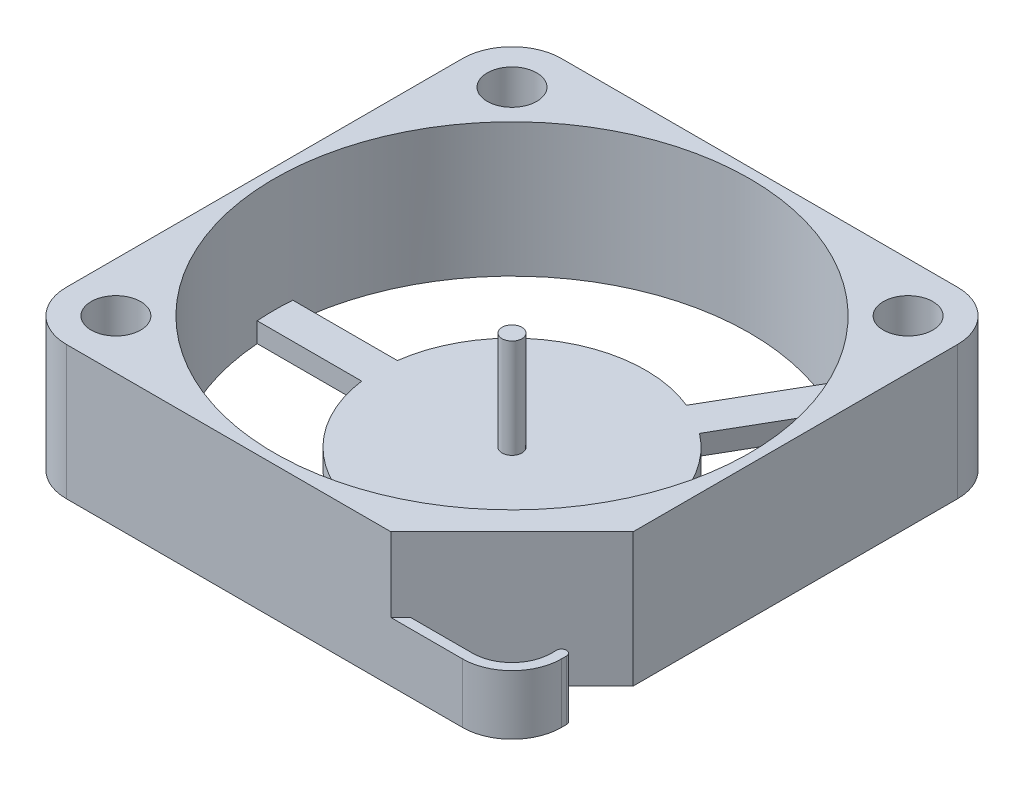
ISO-10303-21;
HEADER;
FILE_DESCRIPTION(('STEP AP214'),'2;1');
FILE_NAME('part.step','',(''),(''),'','','');
FILE_SCHEMA(('AUTOMOTIVE_DESIGN { 1 0 10303 214 1 1 1 1 }'));
ENDSEC;
DATA;
#1=APPLICATION_CONTEXT('core data for automotive mechanical design processes');
#2=APPLICATION_PROTOCOL_DEFINITION('international standard','automotive_design',2000,#1);
#3=PRODUCT_CONTEXT('',#1,'mechanical');
#4=PRODUCT('Part','Part','',(#3));
#5=PRODUCT_RELATED_PRODUCT_CATEGORY('part','',(#4));
#6=PRODUCT_DEFINITION_FORMATION('','',#4);
#7=PRODUCT_DEFINITION_CONTEXT('part definition',#1,'design');
#8=PRODUCT_DEFINITION('design','',#6,#7);
#9=PRODUCT_DEFINITION_SHAPE('','',#8);
#10=(LENGTH_UNIT() NAMED_UNIT(*) SI_UNIT(.MILLI.,.METRE.));
#11=(NAMED_UNIT(*) PLANE_ANGLE_UNIT() SI_UNIT($,.RADIAN.));
#12=(NAMED_UNIT(*) SI_UNIT($,.STERADIAN.) SOLID_ANGLE_UNIT());
#13=UNCERTAINTY_MEASURE_WITH_UNIT(LENGTH_MEASURE(1.E-05),#10,'distance_accuracy_value','');
#14=(GEOMETRIC_REPRESENTATION_CONTEXT(3) GLOBAL_UNCERTAINTY_ASSIGNED_CONTEXT((#13)) GLOBAL_UNIT_ASSIGNED_CONTEXT((#10,
#11,#12)) REPRESENTATION_CONTEXT('',''));
#15=CARTESIAN_POINT('',(0.,0.,0.));
#16=DIRECTION('',(0.,0.,1.));
#17=DIRECTION('',(1.,0.,0.));
#18=AXIS2_PLACEMENT_3D('',#15,#16,#17);
#19=CARTESIAN_POINT('',(0.,6.,0.));
#20=DIRECTION('',(0.,1.,0.));
#21=DIRECTION('',(0.,0.,1.));
#22=AXIS2_PLACEMENT_3D('',#19,#20,#21);
#23=PLANE('',#22);
#24=CARTESIAN_POINT('',(0.,6.,0.));
#25=DIRECTION('',(0.,-1.,0.));
#26=DIRECTION('',(0.,0.,-1.));
#27=AXIS2_PLACEMENT_3D('',#24,#25,#26);
#28=CIRCLE('',#27,0.5);
#29=CARTESIAN_POINT('',(0.,6.,-0.5));
#30=VERTEX_POINT('',#29);
#31=EDGE_CURVE('E239',#30,#30,#28,.T.);
#32=ORIENTED_EDGE('',*,*,#31,.F.);
#33=EDGE_LOOP('',(#32));
#34=FACE_BOUND('',#33,.T.);
#35=ADVANCED_FACE('F24',(#34),#23,.T.);
#36=CARTESIAN_POINT('',(12.25,3.,9.75));
#37=DIRECTION('',(0.,-1.,0.));
#38=DIRECTION('',(0.,0.,-1.));
#39=AXIS2_PLACEMENT_3D('',#36,#37,#38);
#40=CYLINDRICAL_SURFACE('',#39,0.250000000000002);
#41=DIRECTION('',(0.,1.,0.));
#42=VECTOR('',#41,1.);
#43=CARTESIAN_POINT('',(12.5,3.,9.75));
#44=LINE('',#43,#42);
#45=CARTESIAN_POINT('',(12.5,3.,9.75));
#46=VERTEX_POINT('',#45);
#47=CARTESIAN_POINT('',(12.5,0.,9.75));
#48=VERTEX_POINT('',#47);
#49=EDGE_CURVE('E235',#46,#48,#44,.F.);
#50=ORIENTED_EDGE('',*,*,#49,.T.);
#51=CARTESIAN_POINT('',(12.25,0.,9.75));
#52=DIRECTION('',(0.,-1.,0.));
#53=DIRECTION('',(0.,0.,-1.));
#54=AXIS2_PLACEMENT_3D('',#51,#52,#53);
#55=CIRCLE('',#54,0.250000000000002);
#56=CARTESIAN_POINT('',(12.,0.,9.75));
#57=VERTEX_POINT('',#56);
#58=EDGE_CURVE('E228',#48,#57,#55,.F.);
#59=ORIENTED_EDGE('',*,*,#58,.T.);
#60=DIRECTION('',(0.,1.,0.));
#61=VECTOR('',#60,1.);
#62=CARTESIAN_POINT('',(12.,3.,9.75));
#63=LINE('',#62,#61);
#64=CARTESIAN_POINT('',(12.,3.,9.75));
#65=VERTEX_POINT('',#64);
#66=EDGE_CURVE('E232',#57,#65,#63,.T.);
#67=ORIENTED_EDGE('',*,*,#66,.T.);
#68=CARTESIAN_POINT('',(12.25,3.,9.75));
#69=DIRECTION('',(0.,-1.,0.));
#70=DIRECTION('',(0.,0.,-1.));
#71=AXIS2_PLACEMENT_3D('',#68,#69,#70);
#72=CIRCLE('',#71,0.250000000000002);
#73=EDGE_CURVE('E27',#65,#46,#72,.T.);
#74=ORIENTED_EDGE('',*,*,#73,.T.);
#75=EDGE_LOOP('',(#50,#59,#67,#74));
#76=FACE_BOUND('',#75,.T.);
#77=ADVANCED_FACE('F230',(#76),#40,.T.);
#78=CARTESIAN_POINT('',(0.,6.,0.));
#79=DIRECTION('',(0.,-1.,0.));
#80=DIRECTION('',(0.,0.,-1.));
#81=AXIS2_PLACEMENT_3D('',#78,#79,#80);
#82=CYLINDRICAL_SURFACE('',#81,0.5);
#83=ORIENTED_EDGE('',*,*,#31,.T.);
#84=EDGE_LOOP('',(#83));
#85=FACE_BOUND('',#84,.T.);
#86=CARTESIAN_POINT('',(0.,1.,0.));
#87=DIRECTION('',(0.,-1.,0.));
#88=DIRECTION('',(0.,0.,-1.));
#89=AXIS2_PLACEMENT_3D('',#86,#87,#88);
#90=CIRCLE('',#89,0.5);
#91=CARTESIAN_POINT('',(0.,1.,-0.5));
#92=VERTEX_POINT('',#91);
#93=EDGE_CURVE('E398',#92,#92,#90,.T.);
#94=ORIENTED_EDGE('',*,*,#93,.F.);
#95=EDGE_LOOP('',(#94));
#96=FACE_BOUND('',#95,.T.);
#97=ADVANCED_FACE('F914',(#85,#96),#82,.T.);
#98=CARTESIAN_POINT('',(12.,3.,10.));
#99=DIRECTION('',(1.,0.,0.));
#100=DIRECTION('',(0.,0.,-1.));
#101=AXIS2_PLACEMENT_3D('',#98,#99,#100);
#102=PLANE('',#101);
#103=DIRECTION('',(0.,-1.,0.));
#104=VECTOR('',#103,1.);
#105=CARTESIAN_POINT('',(12.,3.,10.));
#106=LINE('',#105,#104);
#107=CARTESIAN_POINT('',(12.,0.,9.99999999999999));
#108=VERTEX_POINT('',#107);
#109=CARTESIAN_POINT('',(12.,3.,10.));
#110=VERTEX_POINT('',#109);
#111=EDGE_CURVE('E377',#108,#110,#106,.F.);
#112=ORIENTED_EDGE('',*,*,#111,.T.);
#113=DIRECTION('',(0.,0.,-1.));
#114=VECTOR('',#113,1.);
#115=CARTESIAN_POINT('',(12.,3.,10.));
#116=LINE('',#115,#114);
#117=EDGE_CURVE('E254',#110,#65,#116,.T.);
#118=ORIENTED_EDGE('',*,*,#117,.T.);
#119=ORIENTED_EDGE('',*,*,#66,.F.);
#120=DIRECTION('',(0.,0.,-1.));
#121=VECTOR('',#120,1.);
#122=CARTESIAN_POINT('',(12.,0.,10.));
#123=LINE('',#122,#121);
#124=EDGE_CURVE('E241',#108,#57,#123,.T.);
#125=ORIENTED_EDGE('',*,*,#124,.F.);
#126=EDGE_LOOP('',(#112,#118,#119,#125));
#127=FACE_BOUND('',#126,.T.);
#128=ADVANCED_FACE('F252',(#127),#102,.F.);
#129=CARTESIAN_POINT('',(12.5,3.,9.75));
#130=DIRECTION('',(-1.,0.,0.));
#131=DIRECTION('',(0.,0.,1.));
#132=AXIS2_PLACEMENT_3D('',#129,#130,#131);
#133=PLANE('',#132);
#134=ORIENTED_EDGE('',*,*,#49,.F.);
#135=DIRECTION('',(0.,0.,-1.));
#136=VECTOR('',#135,1.);
#137=CARTESIAN_POINT('',(12.5,3.,10.));
#138=LINE('',#137,#136);
#139=CARTESIAN_POINT('',(12.5,3.,10.));
#140=VERTEX_POINT('',#139);
#141=EDGE_CURVE('E401',#46,#140,#138,.F.);
#142=ORIENTED_EDGE('',*,*,#141,.T.);
#143=DIRECTION('',(0.,-1.,0.));
#144=VECTOR('',#143,1.);
#145=CARTESIAN_POINT('',(12.5,3.,10.));
#146=LINE('',#145,#144);
#147=CARTESIAN_POINT('',(12.5,0.,10.));
#148=VERTEX_POINT('',#147);
#149=EDGE_CURVE('E372',#148,#140,#146,.F.);
#150=ORIENTED_EDGE('',*,*,#149,.F.);
#151=DIRECTION('',(0.,0.,1.));
#152=VECTOR('',#151,1.);
#153=CARTESIAN_POINT('',(12.5,0.,9.75));
#154=LINE('',#153,#152);
#155=EDGE_CURVE('E417',#48,#148,#154,.T.);
#156=ORIENTED_EDGE('',*,*,#155,.F.);
#157=EDGE_LOOP('',(#134,#142,#150,#156));
#158=FACE_BOUND('',#157,.T.);
#159=ADVANCED_FACE('F909',(#158),#133,.F.);
#160=CARTESIAN_POINT('',(10.,3.,10.));
#161=DIRECTION('',(0.,-1.,0.));
#162=DIRECTION('',(0.,0.,-1.));
#163=AXIS2_PLACEMENT_3D('',#160,#161,#162);
#164=PLANE('',#163);
#165=DIRECTION('',(-0.707106781186548,0.,0.707106781186547));
#166=VECTOR('',#165,1.);
#167=CARTESIAN_POINT('',(6.37975105768082,3.,12.5));
#168=LINE('',#167,#166);
#169=CARTESIAN_POINT('',(6.87975105768085,3.,12.));
#170=VERTEX_POINT('',#169);
#171=CARTESIAN_POINT('',(6.37975105768082,3.,12.5));
#172=VERTEX_POINT('',#171);
#173=EDGE_CURVE('E381',#170,#172,#168,.T.);
#174=ORIENTED_EDGE('',*,*,#173,.T.);
#175=DIRECTION('',(-1.,0.,0.));
#176=VECTOR('',#175,1.);
#177=CARTESIAN_POINT('',(6.37975105768082,3.,12.5));
#178=LINE('',#177,#176);
#179=CARTESIAN_POINT('',(10.,3.,12.5));
#180=VERTEX_POINT('',#179);
#181=EDGE_CURVE('E427',#172,#180,#178,.F.);
#182=ORIENTED_EDGE('',*,*,#181,.T.);
#183=CARTESIAN_POINT('',(10.,3.,10.));
#184=DIRECTION('',(0.,-1.,0.));
#185=DIRECTION('',(0.,0.,-1.));
#186=AXIS2_PLACEMENT_3D('',#183,#184,#185);
#187=CIRCLE('',#186,2.5);
#188=EDGE_CURVE('E368',#140,#180,#187,.T.);
#189=ORIENTED_EDGE('',*,*,#188,.F.);
#190=ORIENTED_EDGE('',*,*,#141,.F.);
#191=ORIENTED_EDGE('',*,*,#73,.F.);
#192=ORIENTED_EDGE('',*,*,#117,.F.);
#193=CARTESIAN_POINT('',(10.,3.,10.));
#194=DIRECTION('',(0.,-1.,0.));
#195=DIRECTION('',(0.,0.,-1.));
#196=AXIS2_PLACEMENT_3D('',#193,#194,#195);
#197=CIRCLE('',#196,1.99999999999999);
#198=CARTESIAN_POINT('',(10.,3.,12.));
#199=VERTEX_POINT('',#198);
#200=EDGE_CURVE('E373',#110,#199,#197,.T.);
#201=ORIENTED_EDGE('',*,*,#200,.T.);
#202=DIRECTION('',(1.,0.,0.));
#203=VECTOR('',#202,1.);
#204=CARTESIAN_POINT('',(6.1726442764943,3.,12.));
#205=LINE('',#204,#203);
#206=EDGE_CURVE('E438',#199,#170,#205,.F.);
#207=ORIENTED_EDGE('',*,*,#206,.T.);
#208=EDGE_LOOP('',(#174,#182,#189,#190,#191,#192,#201,#207));
#209=FACE_BOUND('',#208,.T.);
#210=ADVANCED_FACE('F650',(#209),#164,.F.);
#211=CARTESIAN_POINT('',(-10.,6.75,10.));
#212=DIRECTION('',(0.,-1.,0.));
#213=DIRECTION('',(0.,0.,-1.));
#214=AXIS2_PLACEMENT_3D('',#211,#212,#213);
#215=PLANE('',#214);
#216=CARTESIAN_POINT('',(-10.,6.75,10.));
#217=DIRECTION('',(0.,-1.,0.));
#218=DIRECTION('',(0.,0.,-1.));
#219=AXIS2_PLACEMENT_3D('',#216,#217,#218);
#220=CIRCLE('',#219,1.25);
#221=CARTESIAN_POINT('',(-10.,6.75,8.75));
#222=VERTEX_POINT('',#221);
#223=EDGE_CURVE('E378',#222,#222,#220,.T.);
#224=ORIENTED_EDGE('',*,*,#223,.T.);
#225=EDGE_LOOP('',(#224));
#226=FACE_BOUND('',#225,.T.);
#227=CARTESIAN_POINT('',(0.,6.75,0.));
#228=DIRECTION('',(0.,-1.,0.));
#229=DIRECTION('',(0.,0.,-1.));
#230=AXIS2_PLACEMENT_3D('',#227,#228,#229);
#231=CIRCLE('',#230,12.);
#232=CARTESIAN_POINT('',(0.,6.75,-12.));
#233=VERTEX_POINT('',#232);
#234=EDGE_CURVE('E326',#233,#233,#231,.T.);
#235=ORIENTED_EDGE('',*,*,#234,.T.);
#236=EDGE_LOOP('',(#235));
#237=FACE_BOUND('',#236,.T.);
#238=DIRECTION('',(-1.,0.,0.));
#239=VECTOR('',#238,1.);
#240=CARTESIAN_POINT('',(6.37975105768082,6.75,12.5));
#241=LINE('',#240,#239);
#242=CARTESIAN_POINT('',(-10.,6.75,12.5));
#243=VERTEX_POINT('',#242);
#244=CARTESIAN_POINT('',(6.37975105768082,6.75,12.5));
#245=VERTEX_POINT('',#244);
#246=EDGE_CURVE('E371',#243,#245,#241,.F.);
#247=ORIENTED_EDGE('',*,*,#246,.T.);
#248=DIRECTION('',(-0.707106781186548,0.,0.707106781186547));
#249=VECTOR('',#248,1.);
#250=CARTESIAN_POINT('',(6.37975105768082,6.75,12.5));
#251=LINE('',#250,#249);
#252=CARTESIAN_POINT('',(12.5,6.75,6.37975105768085));
#253=VERTEX_POINT('',#252);
#254=EDGE_CURVE('E433',#245,#253,#251,.F.);
#255=ORIENTED_EDGE('',*,*,#254,.T.);
#256=DIRECTION('',(0.,0.,1.));
#257=VECTOR('',#256,1.);
#258=CARTESIAN_POINT('',(12.5,6.75,6.37975105768085));
#259=LINE('',#258,#257);
#260=CARTESIAN_POINT('',(12.5,6.75,-10.));
#261=VERTEX_POINT('',#260);
#262=EDGE_CURVE('E526',#253,#261,#259,.F.);
#263=ORIENTED_EDGE('',*,*,#262,.T.);
#264=CARTESIAN_POINT('',(10.,6.75,-10.));
#265=DIRECTION('',(0.,-1.,0.));
#266=DIRECTION('',(0.,0.,-1.));
#267=AXIS2_PLACEMENT_3D('',#264,#265,#266);
#268=CIRCLE('',#267,2.5);
#269=CARTESIAN_POINT('',(10.,6.75,-12.5));
#270=VERTEX_POINT('',#269);
#271=EDGE_CURVE('E351',#270,#261,#268,.T.);
#272=ORIENTED_EDGE('',*,*,#271,.F.);
#273=DIRECTION('',(1.,0.,0.));
#274=VECTOR('',#273,1.);
#275=CARTESIAN_POINT('',(10.,6.75,-12.5));
#276=LINE('',#275,#274);
#277=CARTESIAN_POINT('',(-10.,6.75,-12.5));
#278=VERTEX_POINT('',#277);
#279=EDGE_CURVE('E361',#270,#278,#276,.F.);
#280=ORIENTED_EDGE('',*,*,#279,.T.);
#281=CARTESIAN_POINT('',(-10.,6.75,-10.));
#282=DIRECTION('',(0.,-1.,0.));
#283=DIRECTION('',(0.,0.,-1.));
#284=AXIS2_PLACEMENT_3D('',#281,#282,#283);
#285=CIRCLE('',#284,2.5);
#286=CARTESIAN_POINT('',(-12.5,6.75,-10.));
#287=VERTEX_POINT('',#286);
#288=EDGE_CURVE('E357',#287,#278,#285,.T.);
#289=ORIENTED_EDGE('',*,*,#288,.F.);
#290=DIRECTION('',(0.,0.,-1.));
#291=VECTOR('',#290,1.);
#292=CARTESIAN_POINT('',(-12.5,6.75,10.));
#293=LINE('',#292,#291);
#294=CARTESIAN_POINT('',(-12.5,6.75,10.));
#295=VERTEX_POINT('',#294);
#296=EDGE_CURVE('E366',#287,#295,#293,.F.);
#297=ORIENTED_EDGE('',*,*,#296,.T.);
#298=CARTESIAN_POINT('',(-10.,6.75,10.));
#299=DIRECTION('',(0.,-1.,0.));
#300=DIRECTION('',(0.,0.,-1.));
#301=AXIS2_PLACEMENT_3D('',#298,#299,#300);
#302=CIRCLE('',#301,2.5);
#303=EDGE_CURVE('E363',#243,#295,#302,.T.);
#304=ORIENTED_EDGE('',*,*,#303,.F.);
#305=EDGE_LOOP('',(#247,#255,#263,#272,#280,#289,#297,#304));
#306=FACE_BOUND('',#305,.T.);
#307=CARTESIAN_POINT('',(-10.,6.75,-10.));
#308=DIRECTION('',(0.,-1.,0.));
#309=DIRECTION('',(0.,0.,-1.));
#310=AXIS2_PLACEMENT_3D('',#307,#308,#309);
#311=CIRCLE('',#310,1.25);
#312=CARTESIAN_POINT('',(-10.,6.75,-11.25));
#313=VERTEX_POINT('',#312);
#314=EDGE_CURVE('E389',#313,#313,#311,.T.);
#315=ORIENTED_EDGE('',*,*,#314,.T.);
#316=EDGE_LOOP('',(#315));
#317=FACE_BOUND('',#316,.T.);
#318=CARTESIAN_POINT('',(10.,6.75,-10.));
#319=DIRECTION('',(0.,-1.,0.));
#320=DIRECTION('',(0.,0.,-1.));
#321=AXIS2_PLACEMENT_3D('',#318,#319,#320);
#322=CIRCLE('',#321,1.25);
#323=CARTESIAN_POINT('',(10.,6.75,-11.25));
#324=VERTEX_POINT('',#323);
#325=EDGE_CURVE('E394',#324,#324,#322,.T.);
#326=ORIENTED_EDGE('',*,*,#325,.T.);
#327=EDGE_LOOP('',(#326));
#328=FACE_BOUND('',#327,.T.);
#329=ADVANCED_FACE('F768',(#226,#237,#306,#317,#328),#215,.F.);
#330=CARTESIAN_POINT('',(0.,1.,0.));
#331=DIRECTION('',(0.,1.,0.));
#332=DIRECTION('',(0.,0.,1.));
#333=AXIS2_PLACEMENT_3D('',#330,#331,#332);
#334=PLANE('',#333);
#335=ORIENTED_EDGE('',*,*,#93,.T.);
#336=EDGE_LOOP('',(#335));
#337=FACE_BOUND('',#336,.T.);
#338=CARTESIAN_POINT('',(0.,1.,0.));
#339=DIRECTION('',(0.,-1.,0.));
#340=DIRECTION('',(0.,0.,-1.));
#341=AXIS2_PLACEMENT_3D('',#338,#339,#340);
#342=CIRCLE('',#341,6.75);
#343=CARTESIAN_POINT('',(-6.68973093629333,1.,-0.900000000000001));
#344=VERTEX_POINT('',#343);
#345=CARTESIAN_POINT('',(2.56544260474067,1.,-6.24347693531268));
#346=VERTEX_POINT('',#345);
#347=EDGE_CURVE('E340',#344,#346,#342,.T.);
#348=ORIENTED_EDGE('',*,*,#347,.F.);
#349=DIRECTION('',(1.,0.,0.));
#350=VECTOR('',#349,1.);
#351=CARTESIAN_POINT('',(-11.9662024051075,1.,-0.900000000000001));
#352=LINE('',#351,#350);
#353=CARTESIAN_POINT('',(-11.9662024051075,1.,-0.900000000000001));
#354=VERTEX_POINT('',#353);
#355=EDGE_CURVE('E511',#344,#354,#352,.F.);
#356=ORIENTED_EDGE('',*,*,#355,.T.);
#357=CARTESIAN_POINT('',(0.,1.,0.));
#358=DIRECTION('',(0.,-1.,0.));
#359=DIRECTION('',(0.,0.,-1.));
#360=AXIS2_PLACEMENT_3D('',#357,#358,#359);
#361=CIRCLE('',#360,12.);
#362=CARTESIAN_POINT('',(-11.9662024051075,1.,0.900000000000006));
#363=VERTEX_POINT('',#362);
#364=EDGE_CURVE('E346',#354,#363,#361,.F.);
#365=ORIENTED_EDGE('',*,*,#364,.T.);
#366=DIRECTION('',(-1.,0.,0.));
#367=VECTOR('',#366,1.);
#368=CARTESIAN_POINT('',(-11.9662024051075,1.,0.900000000000001));
#369=LINE('',#368,#367);
#370=CARTESIAN_POINT('',(-6.68973093629333,1.,0.900000000000002));
#371=VERTEX_POINT('',#370);
#372=EDGE_CURVE('E387',#363,#371,#369,.F.);
#373=ORIENTED_EDGE('',*,*,#372,.T.);
#374=CARTESIAN_POINT('',(0.,1.,0.));
#375=DIRECTION('',(0.,-1.,0.));
#376=DIRECTION('',(0.,0.,-1.));
#377=AXIS2_PLACEMENT_3D('',#374,#375,#376);
#378=CIRCLE('',#377,6.75);
#379=CARTESIAN_POINT('',(2.56544260474067,1.,6.24347693531267));
#380=VERTEX_POINT('',#379);
#381=EDGE_CURVE('E383',#380,#371,#378,.T.);
#382=ORIENTED_EDGE('',*,*,#381,.F.);
#383=DIRECTION('',(-0.5,0.,-0.866025403784438));
#384=VECTOR('',#383,1.);
#385=CARTESIAN_POINT('',(5.20367833914775,1.,10.8130352696495));
#386=LINE('',#385,#384);
#387=CARTESIAN_POINT('',(5.20367833914775,1.,10.8130352696495));
#388=VERTEX_POINT('',#387);
#389=EDGE_CURVE('E393',#380,#388,#386,.F.);
#390=ORIENTED_EDGE('',*,*,#389,.T.);
#391=CARTESIAN_POINT('',(0.,1.,0.));
#392=DIRECTION('',(0.,-1.,0.));
#393=DIRECTION('',(0.,0.,-1.));
#394=AXIS2_PLACEMENT_3D('',#391,#392,#393);
#395=CIRCLE('',#394,12.);
#396=CARTESIAN_POINT('',(6.76252406595974,1.,9.91303526964952));
#397=VERTEX_POINT('',#396);
#398=EDGE_CURVE('E336',#388,#397,#395,.F.);
#399=ORIENTED_EDGE('',*,*,#398,.T.);
#400=DIRECTION('',(0.5,0.,0.866025403784438));
#401=VECTOR('',#400,1.);
#402=CARTESIAN_POINT('',(6.76252406595974,1.,9.91303526964952));
#403=LINE('',#402,#401);
#404=CARTESIAN_POINT('',(4.12428833155266,1.,5.34347693531267));
#405=VERTEX_POINT('',#404);
#406=EDGE_CURVE('E509',#397,#405,#403,.F.);
#407=ORIENTED_EDGE('',*,*,#406,.T.);
#408=CARTESIAN_POINT('',(0.,1.,0.));
#409=DIRECTION('',(0.,-1.,0.));
#410=DIRECTION('',(0.,0.,-1.));
#411=AXIS2_PLACEMENT_3D('',#408,#409,#410);
#412=CIRCLE('',#411,6.75);
#413=CARTESIAN_POINT('',(4.12428833155266,1.,-5.34347693531268));
#414=VERTEX_POINT('',#413);
#415=EDGE_CURVE('E322',#414,#405,#412,.T.);
#416=ORIENTED_EDGE('',*,*,#415,.F.);
#417=DIRECTION('',(-0.5,0.,0.866025403784439));
#418=VECTOR('',#417,1.);
#419=CARTESIAN_POINT('',(6.76252406595973,1.,-9.91303526964953));
#420=LINE('',#419,#418);
#421=CARTESIAN_POINT('',(6.76252406595973,1.,-9.91303526964952));
#422=VERTEX_POINT('',#421);
#423=EDGE_CURVE('E330',#414,#422,#420,.F.);
#424=ORIENTED_EDGE('',*,*,#423,.T.);
#425=CARTESIAN_POINT('',(0.,1.,0.));
#426=DIRECTION('',(0.,-1.,0.));
#427=DIRECTION('',(0.,0.,-1.));
#428=AXIS2_PLACEMENT_3D('',#425,#426,#427);
#429=CIRCLE('',#428,12.);
#430=CARTESIAN_POINT('',(5.20367833914774,1.,-10.8130352696495));
#431=VERTEX_POINT('',#430);
#432=EDGE_CURVE('E332',#422,#431,#429,.F.);
#433=ORIENTED_EDGE('',*,*,#432,.T.);
#434=DIRECTION('',(0.5,0.,-0.866025403784439));
#435=VECTOR('',#434,1.);
#436=CARTESIAN_POINT('',(5.20367833914774,1.,-10.8130352696495));
#437=LINE('',#436,#435);
#438=EDGE_CURVE('E350',#431,#346,#437,.F.);
#439=ORIENTED_EDGE('',*,*,#438,.T.);
#440=EDGE_LOOP('',(#348,#356,#365,#373,#382,#390,#399,#407,#416,#424,#433,#439));
#441=FACE_BOUND('',#440,.T.);
#442=ADVANCED_FACE('F826',(#337,#441),#334,.T.);
#443=CARTESIAN_POINT('',(10.,6.75,-10.));
#444=DIRECTION('',(0.,-1.,0.));
#445=DIRECTION('',(0.,0.,-1.));
#446=AXIS2_PLACEMENT_3D('',#443,#444,#445);
#447=CYLINDRICAL_SURFACE('',#446,1.25);
#448=ORIENTED_EDGE('',*,*,#325,.F.);
#449=EDGE_LOOP('',(#448));
#450=FACE_BOUND('',#449,.T.);
#451=CARTESIAN_POINT('',(10.,0.,-10.));
#452=DIRECTION('',(0.,-1.,0.));
#453=DIRECTION('',(0.,0.,-1.));
#454=AXIS2_PLACEMENT_3D('',#451,#452,#453);
#455=CIRCLE('',#454,1.25);
#456=CARTESIAN_POINT('',(10.,0.,-11.25));
#457=VERTEX_POINT('',#456);
#458=EDGE_CURVE('E317',#457,#457,#455,.F.);
#459=ORIENTED_EDGE('',*,*,#458,.F.);
#460=EDGE_LOOP('',(#459));
#461=FACE_BOUND('',#460,.T.);
#462=ADVANCED_FACE('F822',(#450,#461),#447,.F.);
#463=CARTESIAN_POINT('',(-10.,6.75,-10.));
#464=DIRECTION('',(0.,-1.,0.));
#465=DIRECTION('',(0.,0.,-1.));
#466=AXIS2_PLACEMENT_3D('',#463,#464,#465);
#467=CYLINDRICAL_SURFACE('',#466,1.25);
#468=ORIENTED_EDGE('',*,*,#314,.F.);
#469=EDGE_LOOP('',(#468));
#470=FACE_BOUND('',#469,.T.);
#471=CARTESIAN_POINT('',(-10.,0.,-10.));
#472=DIRECTION('',(0.,-1.,0.));
#473=DIRECTION('',(0.,0.,-1.));
#474=AXIS2_PLACEMENT_3D('',#471,#472,#473);
#475=CIRCLE('',#474,1.25);
#476=CARTESIAN_POINT('',(-10.,0.,-11.25));
#477=VERTEX_POINT('',#476);
#478=EDGE_CURVE('E313',#477,#477,#475,.F.);
#479=ORIENTED_EDGE('',*,*,#478,.F.);
#480=EDGE_LOOP('',(#479));
#481=FACE_BOUND('',#480,.T.);
#482=ADVANCED_FACE('F825',(#470,#481),#467,.F.);
#483=CARTESIAN_POINT('',(5.20367833914775,1.,10.8130352696495));
#484=DIRECTION('',(0.866025403784438,0.,-0.5));
#485=DIRECTION('',(-0.5,0.,-0.866025403784438));
#486=AXIS2_PLACEMENT_3D('',#483,#484,#485);
#487=PLANE('',#486);
#488=DIRECTION('',(0.,-1.,0.));
#489=VECTOR('',#488,1.);
#490=CARTESIAN_POINT('',(5.20367833914775,6.75,10.8130352696495));
#491=LINE('',#490,#489);
#492=CARTESIAN_POINT('',(5.20367833914775,0.,10.8130352696495));
#493=VERTEX_POINT('',#492);
#494=EDGE_CURVE('E339',#493,#388,#491,.F.);
#495=ORIENTED_EDGE('',*,*,#494,.T.);
#496=ORIENTED_EDGE('',*,*,#389,.F.);
#497=DIRECTION('',(0.,-1.,0.));
#498=VECTOR('',#497,1.);
#499=CARTESIAN_POINT('',(2.56544260474067,1.,6.24347693531267));
#500=LINE('',#499,#498);
#501=CARTESIAN_POINT('',(2.56544260474067,0.,6.24347693531267));
#502=VERTEX_POINT('',#501);
#503=EDGE_CURVE('E388',#502,#380,#500,.F.);
#504=ORIENTED_EDGE('',*,*,#503,.F.);
#505=DIRECTION('',(-0.5,0.,-0.866025403784438));
#506=VECTOR('',#505,1.);
#507=CARTESIAN_POINT('',(5.20367833914775,0.,10.8130352696495));
#508=LINE('',#507,#506);
#509=EDGE_CURVE('E309',#493,#502,#508,.T.);
#510=ORIENTED_EDGE('',*,*,#509,.F.);
#511=EDGE_LOOP('',(#495,#496,#504,#510));
#512=FACE_BOUND('',#511,.T.);
#513=ADVANCED_FACE('F775',(#512),#487,.F.);
#514=CARTESIAN_POINT('',(0.,1.,0.));
#515=DIRECTION('',(0.,-1.,0.));
#516=DIRECTION('',(0.,0.,-1.));
#517=AXIS2_PLACEMENT_3D('',#514,#515,#516);
#518=CYLINDRICAL_SURFACE('',#517,6.75);
#519=ORIENTED_EDGE('',*,*,#381,.T.);
#520=DIRECTION('',(0.,1.,0.));
#521=VECTOR('',#520,1.);
#522=CARTESIAN_POINT('',(-6.68973093629333,1.,0.900000000000002));
#523=LINE('',#522,#521);
#524=CARTESIAN_POINT('',(-6.68973093629333,0.,0.900000000000002));
#525=VERTEX_POINT('',#524);
#526=EDGE_CURVE('E382',#371,#525,#523,.F.);
#527=ORIENTED_EDGE('',*,*,#526,.T.);
#528=CARTESIAN_POINT('',(0.,0.,0.));
#529=DIRECTION('',(0.,-1.,0.));
#530=DIRECTION('',(0.,0.,-1.));
#531=AXIS2_PLACEMENT_3D('',#528,#529,#530);
#532=CIRCLE('',#531,6.75);
#533=EDGE_CURVE('E305',#502,#525,#532,.T.);
#534=ORIENTED_EDGE('',*,*,#533,.F.);
#535=ORIENTED_EDGE('',*,*,#503,.T.);
#536=EDGE_LOOP('',(#519,#527,#534,#535));
#537=FACE_BOUND('',#536,.T.);
#538=ADVANCED_FACE('F771',(#537),#518,.T.);
#539=CARTESIAN_POINT('',(-11.9662024051075,1.,0.900000000000001));
#540=DIRECTION('',(0.,0.,-1.));
#541=DIRECTION('',(-1.,0.,0.));
#542=AXIS2_PLACEMENT_3D('',#539,#540,#541);
#543=PLANE('',#542);
#544=ORIENTED_EDGE('',*,*,#526,.F.);
#545=ORIENTED_EDGE('',*,*,#372,.F.);
#546=DIRECTION('',(0.,-1.,0.));
#547=VECTOR('',#546,1.);
#548=CARTESIAN_POINT('',(-11.9662024051075,6.75,0.900000000000011));
#549=LINE('',#548,#547);
#550=CARTESIAN_POINT('',(-11.9662024051075,0.,0.900000000000006));
#551=VERTEX_POINT('',#550);
#552=EDGE_CURVE('E349',#363,#551,#549,.T.);
#553=ORIENTED_EDGE('',*,*,#552,.T.);
#554=DIRECTION('',(1.,0.,0.));
#555=VECTOR('',#554,1.);
#556=CARTESIAN_POINT('',(-10.,0.,0.900000000000001));
#557=LINE('',#556,#555);
#558=EDGE_CURVE('E304',#525,#551,#557,.F.);
#559=ORIENTED_EDGE('',*,*,#558,.F.);
#560=EDGE_LOOP('',(#544,#545,#553,#559));
#561=FACE_BOUND('',#560,.T.);
#562=ADVANCED_FACE('F774',(#561),#543,.F.);
#563=CARTESIAN_POINT('',(-10.,6.75,10.));
#564=DIRECTION('',(0.,-1.,0.));
#565=DIRECTION('',(0.,0.,-1.));
#566=AXIS2_PLACEMENT_3D('',#563,#564,#565);
#567=CYLINDRICAL_SURFACE('',#566,1.25);
#568=ORIENTED_EDGE('',*,*,#223,.F.);
#569=EDGE_LOOP('',(#568));
#570=FACE_BOUND('',#569,.T.);
#571=CARTESIAN_POINT('',(-10.,0.,10.));
#572=DIRECTION('',(0.,-1.,0.));
#573=DIRECTION('',(0.,0.,-1.));
#574=AXIS2_PLACEMENT_3D('',#571,#572,#573);
#575=CIRCLE('',#574,1.25);
#576=CARTESIAN_POINT('',(-10.,0.,8.75));
#577=VERTEX_POINT('',#576);
#578=EDGE_CURVE('E299',#577,#577,#575,.F.);
#579=ORIENTED_EDGE('',*,*,#578,.F.);
#580=EDGE_LOOP('',(#579));
#581=FACE_BOUND('',#580,.T.);
#582=ADVANCED_FACE('F789',(#570,#581),#567,.F.);
#583=CARTESIAN_POINT('',(6.37975105768082,6.75,12.5));
#584=DIRECTION('',(-0.707106781186547,0.,-0.707106781186548));
#585=DIRECTION('',(-0.707106781186548,0.,0.707106781186547));
#586=AXIS2_PLACEMENT_3D('',#583,#584,#585);
#587=PLANE('',#586);
#588=DIRECTION('',(-0.707106781186548,0.,0.707106781186547));
#589=VECTOR('',#588,1.);
#590=CARTESIAN_POINT('',(12.5,0.,6.37975105768085));
#591=LINE('',#590,#589);
#592=CARTESIAN_POINT('',(12.5,0.,6.37975105768084));
#593=VERTEX_POINT('',#592);
#594=CARTESIAN_POINT('',(6.87975105768085,0.,12.));
#595=VERTEX_POINT('',#594);
#596=EDGE_CURVE('E303',#593,#595,#591,.T.);
#597=ORIENTED_EDGE('',*,*,#596,.F.);
#598=DIRECTION('',(0.,1.,0.));
#599=VECTOR('',#598,1.);
#600=CARTESIAN_POINT('',(12.5,6.75,6.37975105768085));
#601=LINE('',#600,#599);
#602=EDGE_CURVE('E355',#593,#253,#601,.T.);
#603=ORIENTED_EDGE('',*,*,#602,.T.);
#604=ORIENTED_EDGE('',*,*,#254,.F.);
#605=DIRECTION('',(0.,1.,0.));
#606=VECTOR('',#605,1.);
#607=CARTESIAN_POINT('',(6.37975105768082,6.75,12.5));
#608=LINE('',#607,#606);
#609=EDGE_CURVE('E423',#245,#172,#608,.F.);
#610=ORIENTED_EDGE('',*,*,#609,.T.);
#611=ORIENTED_EDGE('',*,*,#173,.F.);
#612=DIRECTION('',(0.,1.,0.));
#613=VECTOR('',#612,1.);
#614=CARTESIAN_POINT('',(6.87975105768084,3.,12.));
#615=LINE('',#614,#613);
#616=EDGE_CURVE('E442',#170,#595,#615,.F.);
#617=ORIENTED_EDGE('',*,*,#616,.T.);
#618=EDGE_LOOP('',(#597,#603,#604,#610,#611,#617));
#619=FACE_BOUND('',#618,.T.);
#620=ADVANCED_FACE('F653',(#619),#587,.F.);
#621=CARTESIAN_POINT('',(6.1726442764943,3.,12.));
#622=DIRECTION('',(0.,0.,1.));
#623=DIRECTION('',(1.,0.,0.));
#624=AXIS2_PLACEMENT_3D('',#621,#622,#623);
#625=PLANE('',#624);
#626=ORIENTED_EDGE('',*,*,#616,.F.);
#627=ORIENTED_EDGE('',*,*,#206,.F.);
#628=DIRECTION('',(0.,-1.,0.));
#629=VECTOR('',#628,1.);
#630=CARTESIAN_POINT('',(10.,3.,12.));
#631=LINE('',#630,#629);
#632=CARTESIAN_POINT('',(10.,0.,12.));
#633=VERTEX_POINT('',#632);
#634=EDGE_CURVE('E376',#199,#633,#631,.T.);
#635=ORIENTED_EDGE('',*,*,#634,.T.);
#636=DIRECTION('',(1.,0.,0.));
#637=VECTOR('',#636,1.);
#638=CARTESIAN_POINT('',(-10.,0.,12.));
#639=LINE('',#638,#637);
#640=EDGE_CURVE('E298',#595,#633,#639,.T.);
#641=ORIENTED_EDGE('',*,*,#640,.F.);
#642=EDGE_LOOP('',(#626,#627,#635,#641));
#643=FACE_BOUND('',#642,.T.);
#644=ADVANCED_FACE('F803',(#643),#625,.F.);
#645=CARTESIAN_POINT('',(10.,3.,10.));
#646=DIRECTION('',(0.,-1.,0.));
#647=DIRECTION('',(0.,0.,-1.));
#648=AXIS2_PLACEMENT_3D('',#645,#646,#647);
#649=CYLINDRICAL_SURFACE('',#648,1.99999999999999);
#650=ORIENTED_EDGE('',*,*,#634,.F.);
#651=ORIENTED_EDGE('',*,*,#200,.F.);
#652=ORIENTED_EDGE('',*,*,#111,.F.);
#653=CARTESIAN_POINT('',(10.,0.,10.));
#654=DIRECTION('',(0.,-1.,0.));
#655=DIRECTION('',(0.,0.,-1.));
#656=AXIS2_PLACEMENT_3D('',#653,#654,#655);
#657=CIRCLE('',#656,1.99999999999999);
#658=EDGE_CURVE('E247',#633,#108,#657,.F.);
#659=ORIENTED_EDGE('',*,*,#658,.F.);
#660=EDGE_LOOP('',(#650,#651,#652,#659));
#661=FACE_BOUND('',#660,.T.);
#662=ADVANCED_FACE('F664',(#661),#649,.F.);
#663=CARTESIAN_POINT('',(10.,3.,10.));
#664=DIRECTION('',(0.,-1.,0.));
#665=DIRECTION('',(0.,0.,-1.));
#666=AXIS2_PLACEMENT_3D('',#663,#664,#665);
#667=CYLINDRICAL_SURFACE('',#666,2.5);
#668=ORIENTED_EDGE('',*,*,#188,.T.);
#669=DIRECTION('',(0.,1.,0.));
#670=VECTOR('',#669,1.);
#671=CARTESIAN_POINT('',(10.,6.75,12.5));
#672=LINE('',#671,#670);
#673=CARTESIAN_POINT('',(10.,0.,12.5));
#674=VERTEX_POINT('',#673);
#675=EDGE_CURVE('E479',#180,#674,#672,.F.);
#676=ORIENTED_EDGE('',*,*,#675,.T.);
#677=CARTESIAN_POINT('',(10.,0.,10.));
#678=DIRECTION('',(0.,-1.,0.));
#679=DIRECTION('',(0.,0.,-1.));
#680=AXIS2_PLACEMENT_3D('',#677,#678,#679);
#681=CIRCLE('',#680,2.5);
#682=EDGE_CURVE('E292',#148,#674,#681,.T.);
#683=ORIENTED_EDGE('',*,*,#682,.F.);
#684=ORIENTED_EDGE('',*,*,#149,.T.);
#685=EDGE_LOOP('',(#668,#676,#683,#684));
#686=FACE_BOUND('',#685,.T.);
#687=ADVANCED_FACE('F656',(#686),#667,.T.);
#688=CARTESIAN_POINT('',(6.37975105768082,6.75,12.5));
#689=DIRECTION('',(0.,0.,-1.));
#690=DIRECTION('',(-1.,0.,0.));
#691=AXIS2_PLACEMENT_3D('',#688,#689,#690);
#692=PLANE('',#691);
#693=ORIENTED_EDGE('',*,*,#675,.F.);
#694=ORIENTED_EDGE('',*,*,#181,.F.);
#695=ORIENTED_EDGE('',*,*,#609,.F.);
#696=ORIENTED_EDGE('',*,*,#246,.F.);
#697=DIRECTION('',(0.,-1.,0.));
#698=VECTOR('',#697,1.);
#699=CARTESIAN_POINT('',(-10.,6.75,12.5));
#700=LINE('',#699,#698);
#701=CARTESIAN_POINT('',(-10.,0.,12.5));
#702=VERTEX_POINT('',#701);
#703=EDGE_CURVE('E367',#702,#243,#700,.F.);
#704=ORIENTED_EDGE('',*,*,#703,.F.);
#705=DIRECTION('',(1.,0.,0.));
#706=VECTOR('',#705,1.);
#707=CARTESIAN_POINT('',(-10.,0.,12.5));
#708=LINE('',#707,#706);
#709=EDGE_CURVE('E291',#674,#702,#708,.F.);
#710=ORIENTED_EDGE('',*,*,#709,.F.);
#711=EDGE_LOOP('',(#693,#694,#695,#696,#704,#710));
#712=FACE_BOUND('',#711,.T.);
#713=ADVANCED_FACE('F654',(#712),#692,.F.);
#714=CARTESIAN_POINT('',(-10.,6.75,10.));
#715=DIRECTION('',(0.,-1.,0.));
#716=DIRECTION('',(0.,0.,-1.));
#717=AXIS2_PLACEMENT_3D('',#714,#715,#716);
#718=CYLINDRICAL_SURFACE('',#717,2.5);
#719=ORIENTED_EDGE('',*,*,#303,.T.);
#720=DIRECTION('',(0.,1.,0.));
#721=VECTOR('',#720,1.);
#722=CARTESIAN_POINT('',(-12.5,6.75,10.));
#723=LINE('',#722,#721);
#724=CARTESIAN_POINT('',(-12.5,0.,10.));
#725=VERTEX_POINT('',#724);
#726=EDGE_CURVE('E474',#295,#725,#723,.F.);
#727=ORIENTED_EDGE('',*,*,#726,.T.);
#728=CARTESIAN_POINT('',(-10.,0.,10.));
#729=DIRECTION('',(0.,-1.,0.));
#730=DIRECTION('',(0.,0.,-1.));
#731=AXIS2_PLACEMENT_3D('',#728,#729,#730);
#732=CIRCLE('',#731,2.5);
#733=EDGE_CURVE('E287',#702,#725,#732,.T.);
#734=ORIENTED_EDGE('',*,*,#733,.F.);
#735=ORIENTED_EDGE('',*,*,#703,.T.);
#736=EDGE_LOOP('',(#719,#727,#734,#735));
#737=FACE_BOUND('',#736,.T.);
#738=ADVANCED_FACE('F560',(#737),#718,.T.);
#739=CARTESIAN_POINT('',(-12.5,6.75,10.));
#740=DIRECTION('',(1.,0.,0.));
#741=DIRECTION('',(0.,0.,-1.));
#742=AXIS2_PLACEMENT_3D('',#739,#740,#741);
#743=PLANE('',#742);
#744=ORIENTED_EDGE('',*,*,#726,.F.);
#745=ORIENTED_EDGE('',*,*,#296,.F.);
#746=DIRECTION('',(0.,-1.,0.));
#747=VECTOR('',#746,1.);
#748=CARTESIAN_POINT('',(-12.5,6.75,-10.));
#749=LINE('',#748,#747);
#750=CARTESIAN_POINT('',(-12.5,0.,-10.));
#751=VERTEX_POINT('',#750);
#752=EDGE_CURVE('E362',#751,#287,#749,.F.);
#753=ORIENTED_EDGE('',*,*,#752,.F.);
#754=DIRECTION('',(0.,0.,-1.));
#755=VECTOR('',#754,1.);
#756=CARTESIAN_POINT('',(-12.5,0.,10.));
#757=LINE('',#756,#755);
#758=EDGE_CURVE('E286',#725,#751,#757,.T.);
#759=ORIENTED_EDGE('',*,*,#758,.F.);
#760=EDGE_LOOP('',(#744,#745,#753,#759));
#761=FACE_BOUND('',#760,.T.);
#762=ADVANCED_FACE('F565',(#761),#743,.F.);
#763=CARTESIAN_POINT('',(-10.,6.75,-10.));
#764=DIRECTION('',(0.,-1.,0.));
#765=DIRECTION('',(0.,0.,-1.));
#766=AXIS2_PLACEMENT_3D('',#763,#764,#765);
#767=CYLINDRICAL_SURFACE('',#766,2.5);
#768=ORIENTED_EDGE('',*,*,#288,.T.);
#769=DIRECTION('',(0.,1.,0.));
#770=VECTOR('',#769,1.);
#771=CARTESIAN_POINT('',(-10.,6.75,-12.5));
#772=LINE('',#771,#770);
#773=CARTESIAN_POINT('',(-10.,0.,-12.5));
#774=VERTEX_POINT('',#773);
#775=EDGE_CURVE('E471',#278,#774,#772,.F.);
#776=ORIENTED_EDGE('',*,*,#775,.T.);
#777=CARTESIAN_POINT('',(-10.,0.,-10.));
#778=DIRECTION('',(0.,-1.,0.));
#779=DIRECTION('',(0.,0.,-1.));
#780=AXIS2_PLACEMENT_3D('',#777,#778,#779);
#781=CIRCLE('',#780,2.5);
#782=EDGE_CURVE('E283',#751,#774,#781,.T.);
#783=ORIENTED_EDGE('',*,*,#782,.F.);
#784=ORIENTED_EDGE('',*,*,#752,.T.);
#785=EDGE_LOOP('',(#768,#776,#783,#784));
#786=FACE_BOUND('',#785,.T.);
#787=ADVANCED_FACE('F703',(#786),#767,.T.);
#788=CARTESIAN_POINT('',(10.,6.75,-12.5));
#789=DIRECTION('',(0.,0.,1.));
#790=DIRECTION('',(1.,0.,0.));
#791=AXIS2_PLACEMENT_3D('',#788,#789,#790);
#792=PLANE('',#791);
#793=ORIENTED_EDGE('',*,*,#775,.F.);
#794=ORIENTED_EDGE('',*,*,#279,.F.);
#795=DIRECTION('',(0.,-1.,0.));
#796=VECTOR('',#795,1.);
#797=CARTESIAN_POINT('',(10.,6.75,-12.5));
#798=LINE('',#797,#796);
#799=CARTESIAN_POINT('',(10.,0.,-12.5));
#800=VERTEX_POINT('',#799);
#801=EDGE_CURVE('E356',#800,#270,#798,.F.);
#802=ORIENTED_EDGE('',*,*,#801,.F.);
#803=DIRECTION('',(1.,0.,0.));
#804=VECTOR('',#803,1.);
#805=CARTESIAN_POINT('',(-10.,0.,-12.5));
#806=LINE('',#805,#804);
#807=EDGE_CURVE('E282',#774,#800,#806,.T.);
#808=ORIENTED_EDGE('',*,*,#807,.F.);
#809=EDGE_LOOP('',(#793,#794,#802,#808));
#810=FACE_BOUND('',#809,.T.);
#811=ADVANCED_FACE('F633',(#810),#792,.F.);
#812=CARTESIAN_POINT('',(10.,6.75,-10.));
#813=DIRECTION('',(0.,-1.,0.));
#814=DIRECTION('',(0.,0.,-1.));
#815=AXIS2_PLACEMENT_3D('',#812,#813,#814);
#816=CYLINDRICAL_SURFACE('',#815,2.5);
#817=ORIENTED_EDGE('',*,*,#271,.T.);
#818=DIRECTION('',(0.,1.,0.));
#819=VECTOR('',#818,1.);
#820=CARTESIAN_POINT('',(12.5,6.75,-10.));
#821=LINE('',#820,#819);
#822=CARTESIAN_POINT('',(12.5,0.,-10.));
#823=VERTEX_POINT('',#822);
#824=EDGE_CURVE('E519',#261,#823,#821,.F.);
#825=ORIENTED_EDGE('',*,*,#824,.T.);
#826=CARTESIAN_POINT('',(10.,0.,-10.));
#827=DIRECTION('',(0.,-1.,0.));
#828=DIRECTION('',(0.,0.,-1.));
#829=AXIS2_PLACEMENT_3D('',#826,#827,#828);
#830=CIRCLE('',#829,2.5);
#831=EDGE_CURVE('E278',#800,#823,#830,.T.);
#832=ORIENTED_EDGE('',*,*,#831,.F.);
#833=ORIENTED_EDGE('',*,*,#801,.T.);
#834=EDGE_LOOP('',(#817,#825,#832,#833));
#835=FACE_BOUND('',#834,.T.);
#836=ADVANCED_FACE('F635',(#835),#816,.T.);
#837=CARTESIAN_POINT('',(12.5,6.75,6.37975105768085));
#838=DIRECTION('',(-1.,0.,0.));
#839=DIRECTION('',(0.,0.,1.));
#840=AXIS2_PLACEMENT_3D('',#837,#838,#839);
#841=PLANE('',#840);
#842=ORIENTED_EDGE('',*,*,#824,.F.);
#843=ORIENTED_EDGE('',*,*,#262,.F.);
#844=ORIENTED_EDGE('',*,*,#602,.F.);
#845=DIRECTION('',(0.,0.,-1.));
#846=VECTOR('',#845,1.);
#847=CARTESIAN_POINT('',(12.5,0.,10.));
#848=LINE('',#847,#846);
#849=EDGE_CURVE('E281',#823,#593,#848,.F.);
#850=ORIENTED_EDGE('',*,*,#849,.F.);
#851=EDGE_LOOP('',(#842,#843,#844,#850));
#852=FACE_BOUND('',#851,.T.);
#853=ADVANCED_FACE('F639',(#852),#841,.F.);
#854=CARTESIAN_POINT('',(5.20367833914774,1.,-10.8130352696495));
#855=DIRECTION('',(0.866025403784439,0.,0.5));
#856=DIRECTION('',(0.5,0.,-0.866025403784439));
#857=AXIS2_PLACEMENT_3D('',#854,#855,#856);
#858=PLANE('',#857);
#859=DIRECTION('',(0.,-1.,0.));
#860=VECTOR('',#859,1.);
#861=CARTESIAN_POINT('',(2.56544260474067,1.,-6.24347693531269));
#862=LINE('',#861,#860);
#863=CARTESIAN_POINT('',(2.56544260474067,0.,-6.24347693531268));
#864=VERTEX_POINT('',#863);
#865=EDGE_CURVE('E344',#346,#864,#862,.T.);
#866=ORIENTED_EDGE('',*,*,#865,.F.);
#867=ORIENTED_EDGE('',*,*,#438,.F.);
#868=DIRECTION('',(0.,-1.,0.));
#869=VECTOR('',#868,1.);
#870=CARTESIAN_POINT('',(5.20367833914774,6.75,-10.8130352696495));
#871=LINE('',#870,#869);
#872=CARTESIAN_POINT('',(5.20367833914774,0.,-10.8130352696495));
#873=VERTEX_POINT('',#872);
#874=EDGE_CURVE('E331',#431,#873,#871,.T.);
#875=ORIENTED_EDGE('',*,*,#874,.T.);
#876=DIRECTION('',(0.5,0.,-0.866025403784439));
#877=VECTOR('',#876,1.);
#878=CARTESIAN_POINT('',(2.56544260474067,0.,-6.24347693531269));
#879=LINE('',#878,#877);
#880=EDGE_CURVE('E277',#864,#873,#879,.T.);
#881=ORIENTED_EDGE('',*,*,#880,.F.);
#882=EDGE_LOOP('',(#866,#867,#875,#881));
#883=FACE_BOUND('',#882,.T.);
#884=ADVANCED_FACE('F607',(#883),#858,.F.);
#885=CARTESIAN_POINT('',(-11.9662024051075,1.,-0.900000000000001));
#886=DIRECTION('',(0.,0.,1.));
#887=DIRECTION('',(1.,0.,0.));
#888=AXIS2_PLACEMENT_3D('',#885,#886,#887);
#889=PLANE('',#888);
#890=DIRECTION('',(0.,1.,0.));
#891=VECTOR('',#890,1.);
#892=CARTESIAN_POINT('',(-11.9662024051075,1.,-0.900000000000001));
#893=LINE('',#892,#891);
#894=CARTESIAN_POINT('',(-11.9662024051075,0.,-0.900000000000001));
#895=VERTEX_POINT('',#894);
#896=EDGE_CURVE('E524',#354,#895,#893,.F.);
#897=ORIENTED_EDGE('',*,*,#896,.F.);
#898=ORIENTED_EDGE('',*,*,#355,.F.);
#899=DIRECTION('',(0.,-1.,0.));
#900=VECTOR('',#899,1.);
#901=CARTESIAN_POINT('',(-6.68973093629333,1.,-0.900000000000001));
#902=LINE('',#901,#900);
#903=CARTESIAN_POINT('',(-6.68973093629333,0.,-0.900000000000001));
#904=VERTEX_POINT('',#903);
#905=EDGE_CURVE('E345',#904,#344,#902,.F.);
#906=ORIENTED_EDGE('',*,*,#905,.F.);
#907=DIRECTION('',(1.,0.,0.));
#908=VECTOR('',#907,1.);
#909=CARTESIAN_POINT('',(-10.,0.,-0.900000000000001));
#910=LINE('',#909,#908);
#911=EDGE_CURVE('E273',#895,#904,#910,.T.);
#912=ORIENTED_EDGE('',*,*,#911,.F.);
#913=EDGE_LOOP('',(#897,#898,#906,#912));
#914=FACE_BOUND('',#913,.T.);
#915=ADVANCED_FACE('F690',(#914),#889,.F.);
#916=CARTESIAN_POINT('',(0.,1.,0.));
#917=DIRECTION('',(0.,-1.,0.));
#918=DIRECTION('',(0.,0.,-1.));
#919=AXIS2_PLACEMENT_3D('',#916,#917,#918);
#920=CYLINDRICAL_SURFACE('',#919,6.75);
#921=ORIENTED_EDGE('',*,*,#865,.T.);
#922=CARTESIAN_POINT('',(0.,0.,0.));
#923=DIRECTION('',(0.,-1.,0.));
#924=DIRECTION('',(0.,0.,-1.));
#925=AXIS2_PLACEMENT_3D('',#922,#923,#924);
#926=CIRCLE('',#925,6.75);
#927=EDGE_CURVE('E270',#904,#864,#926,.T.);
#928=ORIENTED_EDGE('',*,*,#927,.F.);
#929=ORIENTED_EDGE('',*,*,#905,.T.);
#930=ORIENTED_EDGE('',*,*,#347,.T.);
#931=EDGE_LOOP('',(#921,#928,#929,#930));
#932=FACE_BOUND('',#931,.T.);
#933=ADVANCED_FACE('F686',(#932),#920,.T.);
#934=CARTESIAN_POINT('',(6.76252406595974,1.,9.91303526964952));
#935=DIRECTION('',(-0.866025403784438,0.,0.5));
#936=DIRECTION('',(0.5,0.,0.866025403784438));
#937=AXIS2_PLACEMENT_3D('',#934,#935,#936);
#938=PLANE('',#937);
#939=DIRECTION('',(0.,-1.,0.));
#940=VECTOR('',#939,1.);
#941=CARTESIAN_POINT('',(4.12428833155266,1.,5.34347693531267));
#942=LINE('',#941,#940);
#943=CARTESIAN_POINT('',(4.12428833155266,0.,5.34347693531267));
#944=VERTEX_POINT('',#943);
#945=EDGE_CURVE('E321',#405,#944,#942,.T.);
#946=ORIENTED_EDGE('',*,*,#945,.F.);
#947=ORIENTED_EDGE('',*,*,#406,.F.);
#948=DIRECTION('',(0.,-1.,0.));
#949=VECTOR('',#948,1.);
#950=CARTESIAN_POINT('',(6.76252406595974,6.75,9.91303526964952));
#951=LINE('',#950,#949);
#952=CARTESIAN_POINT('',(6.76252406595974,0.,9.91303526964952));
#953=VERTEX_POINT('',#952);
#954=EDGE_CURVE('E335',#397,#953,#951,.T.);
#955=ORIENTED_EDGE('',*,*,#954,.T.);
#956=DIRECTION('',(0.5,0.,0.866025403784438));
#957=VECTOR('',#956,1.);
#958=CARTESIAN_POINT('',(4.12428833155266,0.,5.34347693531267));
#959=LINE('',#958,#957);
#960=EDGE_CURVE('E269',#944,#953,#959,.T.);
#961=ORIENTED_EDGE('',*,*,#960,.F.);
#962=EDGE_LOOP('',(#946,#947,#955,#961));
#963=FACE_BOUND('',#962,.T.);
#964=ADVANCED_FACE('F682',(#963),#938,.F.);
#965=CARTESIAN_POINT('',(0.,6.75,0.));
#966=DIRECTION('',(0.,-1.,0.));
#967=DIRECTION('',(0.,0.,-1.));
#968=AXIS2_PLACEMENT_3D('',#965,#966,#967);
#969=CYLINDRICAL_SURFACE('',#968,12.);
#970=ORIENTED_EDGE('',*,*,#234,.F.);
#971=EDGE_LOOP('',(#970));
#972=FACE_BOUND('',#971,.T.);
#973=ORIENTED_EDGE('',*,*,#896,.T.);
#974=CARTESIAN_POINT('',(0.,0.,0.));
#975=DIRECTION('',(0.,-1.,0.));
#976=DIRECTION('',(0.,0.,-1.));
#977=AXIS2_PLACEMENT_3D('',#974,#975,#976);
#978=CIRCLE('',#977,12.);
#979=EDGE_CURVE('E274',#873,#895,#978,.F.);
#980=ORIENTED_EDGE('',*,*,#979,.F.);
#981=ORIENTED_EDGE('',*,*,#874,.F.);
#982=ORIENTED_EDGE('',*,*,#432,.F.);
#983=DIRECTION('',(0.,1.,0.));
#984=VECTOR('',#983,1.);
#985=CARTESIAN_POINT('',(6.76252406595973,1.,-9.91303526964953));
#986=LINE('',#985,#984);
#987=CARTESIAN_POINT('',(6.76252406595973,0.,-9.91303526964952));
#988=VERTEX_POINT('',#987);
#989=EDGE_CURVE('E516',#422,#988,#986,.F.);
#990=ORIENTED_EDGE('',*,*,#989,.T.);
#991=CARTESIAN_POINT('',(0.,0.,0.));
#992=DIRECTION('',(0.,-1.,0.));
#993=DIRECTION('',(0.,0.,-1.));
#994=AXIS2_PLACEMENT_3D('',#991,#992,#993);
#995=CIRCLE('',#994,12.);
#996=EDGE_CURVE('E265',#953,#988,#995,.F.);
#997=ORIENTED_EDGE('',*,*,#996,.F.);
#998=ORIENTED_EDGE('',*,*,#954,.F.);
#999=ORIENTED_EDGE('',*,*,#398,.F.);
#1000=ORIENTED_EDGE('',*,*,#494,.F.);
#1001=CARTESIAN_POINT('',(0.,0.,0.));
#1002=DIRECTION('',(0.,-1.,0.));
#1003=DIRECTION('',(0.,0.,-1.));
#1004=AXIS2_PLACEMENT_3D('',#1001,#1002,#1003);
#1005=CIRCLE('',#1004,12.);
#1006=EDGE_CURVE('E310',#551,#493,#1005,.F.);
#1007=ORIENTED_EDGE('',*,*,#1006,.F.);
#1008=ORIENTED_EDGE('',*,*,#552,.F.);
#1009=ORIENTED_EDGE('',*,*,#364,.F.);
#1010=EDGE_LOOP('',(#973,#980,#981,#982,#990,#997,#998,#999,#1000,#1007,#1008,#1009));
#1011=FACE_BOUND('',#1010,.T.);
#1012=ADVANCED_FACE('F611',(#972,#1011),#969,.F.);
#1013=CARTESIAN_POINT('',(6.76252406595973,1.,-9.91303526964953));
#1014=DIRECTION('',(-0.866025403784439,0.,-0.5));
#1015=DIRECTION('',(-0.5,0.,0.866025403784439));
#1016=AXIS2_PLACEMENT_3D('',#1013,#1014,#1015);
#1017=PLANE('',#1016);
#1018=ORIENTED_EDGE('',*,*,#989,.F.);
#1019=ORIENTED_EDGE('',*,*,#423,.F.);
#1020=DIRECTION('',(0.,-1.,0.));
#1021=VECTOR('',#1020,1.);
#1022=CARTESIAN_POINT('',(4.12428833155266,1.,-5.34347693531269));
#1023=LINE('',#1022,#1021);
#1024=CARTESIAN_POINT('',(4.12428833155266,0.,-5.34347693531269));
#1025=VERTEX_POINT('',#1024);
#1026=EDGE_CURVE('E47',#1025,#414,#1023,.F.);
#1027=ORIENTED_EDGE('',*,*,#1026,.F.);
#1028=DIRECTION('',(-0.5,0.,0.866025403784439));
#1029=VECTOR('',#1028,1.);
#1030=CARTESIAN_POINT('',(6.76252406595973,0.,-9.91303526964952));
#1031=LINE('',#1030,#1029);
#1032=EDGE_CURVE('E34',#988,#1025,#1031,.T.);
#1033=ORIENTED_EDGE('',*,*,#1032,.F.);
#1034=EDGE_LOOP('',(#1018,#1019,#1027,#1033));
#1035=FACE_BOUND('',#1034,.T.);
#1036=ADVANCED_FACE('F673',(#1035),#1017,.F.);
#1037=CARTESIAN_POINT('',(0.,1.,0.));
#1038=DIRECTION('',(0.,-1.,0.));
#1039=DIRECTION('',(0.,0.,-1.));
#1040=AXIS2_PLACEMENT_3D('',#1037,#1038,#1039);
#1041=CYLINDRICAL_SURFACE('',#1040,6.75);
#1042=ORIENTED_EDGE('',*,*,#415,.T.);
#1043=ORIENTED_EDGE('',*,*,#945,.T.);
#1044=CARTESIAN_POINT('',(0.,0.,0.));
#1045=DIRECTION('',(0.,-1.,0.));
#1046=DIRECTION('',(0.,0.,-1.));
#1047=AXIS2_PLACEMENT_3D('',#1044,#1045,#1046);
#1048=CIRCLE('',#1047,6.75);
#1049=EDGE_CURVE('E13',#1025,#944,#1048,.T.);
#1050=ORIENTED_EDGE('',*,*,#1049,.F.);
#1051=ORIENTED_EDGE('',*,*,#1026,.T.);
#1052=EDGE_LOOP('',(#1042,#1043,#1050,#1051));
#1053=FACE_BOUND('',#1052,.T.);
#1054=ADVANCED_FACE('F667',(#1053),#1041,.T.);
#1055=CARTESIAN_POINT('',(-10.,0.,10.));
#1056=DIRECTION('',(0.,-1.,0.));
#1057=DIRECTION('',(0.,0.,-1.));
#1058=AXIS2_PLACEMENT_3D('',#1055,#1056,#1057);
#1059=PLANE('',#1058);
#1060=ORIENTED_EDGE('',*,*,#1032,.T.);
#1061=ORIENTED_EDGE('',*,*,#1049,.T.);
#1062=ORIENTED_EDGE('',*,*,#960,.T.);
#1063=ORIENTED_EDGE('',*,*,#996,.T.);
#1064=EDGE_LOOP('',(#1060,#1061,#1062,#1063));
#1065=FACE_BOUND('',#1064,.T.);
#1066=ORIENTED_EDGE('',*,*,#927,.T.);
#1067=ORIENTED_EDGE('',*,*,#880,.T.);
#1068=ORIENTED_EDGE('',*,*,#979,.T.);
#1069=ORIENTED_EDGE('',*,*,#911,.T.);
#1070=EDGE_LOOP('',(#1066,#1067,#1068,#1069));
#1071=FACE_BOUND('',#1070,.T.);
#1072=ORIENTED_EDGE('',*,*,#831,.T.);
#1073=ORIENTED_EDGE('',*,*,#849,.T.);
#1074=ORIENTED_EDGE('',*,*,#596,.T.);
#1075=ORIENTED_EDGE('',*,*,#640,.T.);
#1076=ORIENTED_EDGE('',*,*,#658,.T.);
#1077=ORIENTED_EDGE('',*,*,#124,.T.);
#1078=ORIENTED_EDGE('',*,*,#58,.F.);
#1079=ORIENTED_EDGE('',*,*,#155,.T.);
#1080=ORIENTED_EDGE('',*,*,#682,.T.);
#1081=ORIENTED_EDGE('',*,*,#709,.T.);
#1082=ORIENTED_EDGE('',*,*,#733,.T.);
#1083=ORIENTED_EDGE('',*,*,#758,.T.);
#1084=ORIENTED_EDGE('',*,*,#782,.T.);
#1085=ORIENTED_EDGE('',*,*,#807,.T.);
#1086=EDGE_LOOP('',(#1072,#1073,#1074,#1075,#1076,#1077,#1078,#1079,#1080,#1081,#1082,#1083,
#1084,#1085));
#1087=FACE_BOUND('',#1086,.T.);
#1088=ORIENTED_EDGE('',*,*,#578,.T.);
#1089=EDGE_LOOP('',(#1088));
#1090=FACE_BOUND('',#1089,.T.);
#1091=ORIENTED_EDGE('',*,*,#533,.T.);
#1092=ORIENTED_EDGE('',*,*,#558,.T.);
#1093=ORIENTED_EDGE('',*,*,#1006,.T.);
#1094=ORIENTED_EDGE('',*,*,#509,.T.);
#1095=EDGE_LOOP('',(#1091,#1092,#1093,#1094));
#1096=FACE_BOUND('',#1095,.T.);
#1097=ORIENTED_EDGE('',*,*,#478,.T.);
#1098=EDGE_LOOP('',(#1097));
#1099=FACE_BOUND('',#1098,.T.);
#1100=ORIENTED_EDGE('',*,*,#458,.T.);
#1101=EDGE_LOOP('',(#1100));
#1102=FACE_BOUND('',#1101,.T.);
#1103=ADVANCED_FACE('F243',(#1065,#1071,#1087,#1090,#1096,#1099,#1102),#1059,.T.);
#1104=CLOSED_SHELL('',(#35,#77,#97,#128,#159,#210,#329,#442,#462,#482,#513,#538,#562,#582,#620,
#644,#662,#687,#713,#738,#762,#787,#811,#836,#853,#884,#915,#933,#964,#1012,#1036,#1054,#1103));
#1105=MANIFOLD_SOLID_BREP('B1',#1104);
#1106=ADVANCED_BREP_SHAPE_REPRESENTATION('',(#18,#1105),#14);
#1107=SHAPE_DEFINITION_REPRESENTATION(#9,#1106);
ENDSEC;
END-ISO-10303-21;
